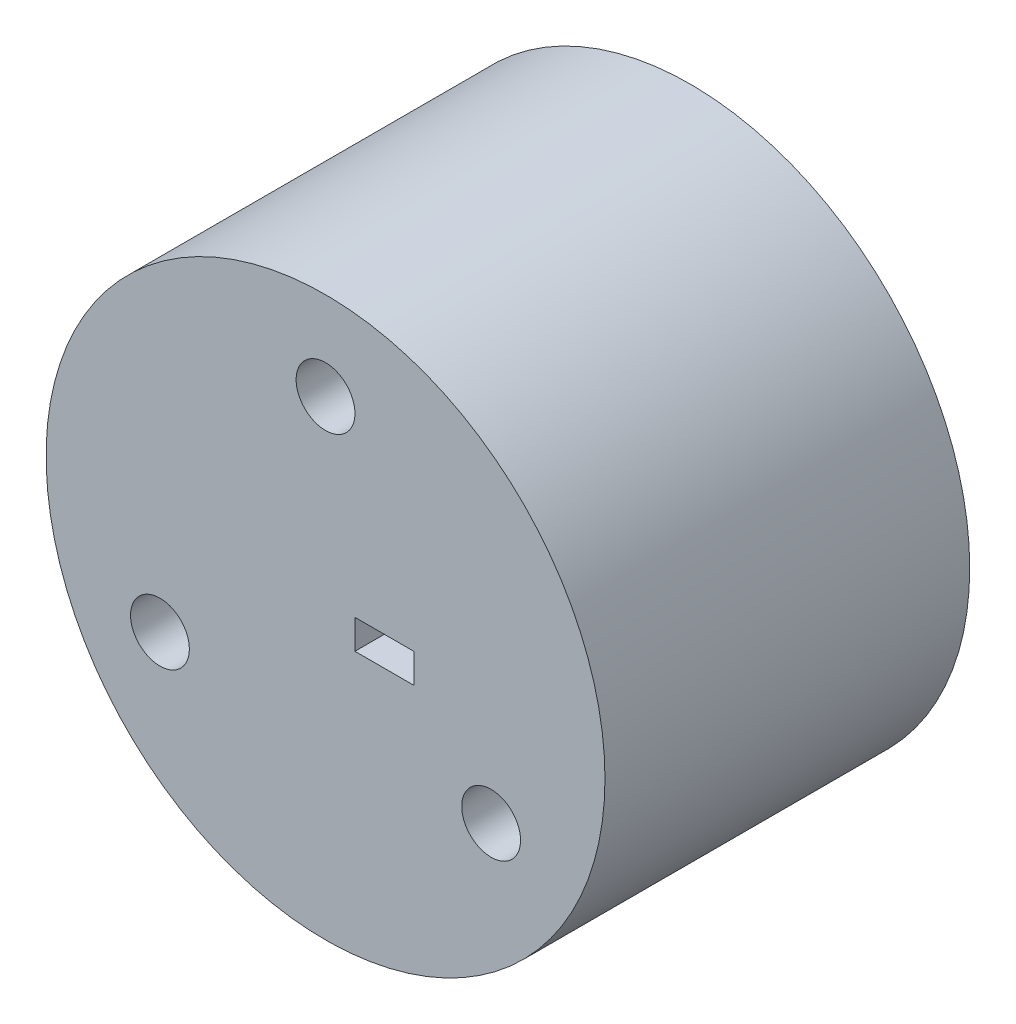
ISO-10303-21;
HEADER;
FILE_DESCRIPTION(('STEP AP214'),'2;1');
FILE_NAME('part.step','',(''),(''),'','','');
FILE_SCHEMA(('AUTOMOTIVE_DESIGN { 1 0 10303 214 1 1 1 1 }'));
ENDSEC;
DATA;
#1=APPLICATION_CONTEXT('core data for automotive mechanical design processes');
#2=APPLICATION_PROTOCOL_DEFINITION('international standard','automotive_design',2000,#1);
#3=PRODUCT_CONTEXT('',#1,'mechanical');
#4=PRODUCT('Part','Part','',(#3));
#5=PRODUCT_RELATED_PRODUCT_CATEGORY('part','',(#4));
#6=PRODUCT_DEFINITION_FORMATION('','',#4);
#7=PRODUCT_DEFINITION_CONTEXT('part definition',#1,'design');
#8=PRODUCT_DEFINITION('design','',#6,#7);
#9=PRODUCT_DEFINITION_SHAPE('','',#8);
#10=(LENGTH_UNIT() NAMED_UNIT(*) SI_UNIT(.MILLI.,.METRE.));
#11=(NAMED_UNIT(*) PLANE_ANGLE_UNIT() SI_UNIT($,.RADIAN.));
#12=(NAMED_UNIT(*) SI_UNIT($,.STERADIAN.) SOLID_ANGLE_UNIT());
#13=UNCERTAINTY_MEASURE_WITH_UNIT(LENGTH_MEASURE(1.E-05),#10,'distance_accuracy_value','');
#14=(GEOMETRIC_REPRESENTATION_CONTEXT(3) GLOBAL_UNCERTAINTY_ASSIGNED_CONTEXT((#13)) GLOBAL_UNIT_ASSIGNED_CONTEXT((#10,
#11,#12)) REPRESENTATION_CONTEXT('',''));
#15=CARTESIAN_POINT('',(0.,0.,0.));
#16=DIRECTION('',(0.,0.,1.));
#17=DIRECTION('',(1.,0.,0.));
#18=AXIS2_PLACEMENT_3D('',#15,#16,#17);
#19=CARTESIAN_POINT('',(0.,0.,62.));
#20=DIRECTION('',(0.,0.,-1.));
#21=DIRECTION('',(-1.,0.,0.));
#22=AXIS2_PLACEMENT_3D('',#19,#20,#21);
#23=CYLINDRICAL_SURFACE('',#22,47.5);
#24=CARTESIAN_POINT('',(0.,0.,62.));
#25=DIRECTION('',(0.,0.,1.));
#26=DIRECTION('',(1.,0.,0.));
#27=AXIS2_PLACEMENT_3D('',#24,#25,#26);
#28=CIRCLE('',#27,47.5);
#29=CARTESIAN_POINT('',(47.5,0.,62.));
#30=VERTEX_POINT('',#29);
#31=EDGE_CURVE('E11',#30,#30,#28,.T.);
#32=ORIENTED_EDGE('',*,*,#31,.F.);
#33=EDGE_LOOP('',(#32));
#34=FACE_BOUND('',#33,.T.);
#35=CARTESIAN_POINT('',(0.,0.,0.));
#36=DIRECTION('',(0.,0.,1.));
#37=DIRECTION('',(1.,0.,0.));
#38=AXIS2_PLACEMENT_3D('',#35,#36,#37);
#39=CIRCLE('',#38,47.5);
#40=CARTESIAN_POINT('',(47.5,0.,0.));
#41=VERTEX_POINT('',#40);
#42=EDGE_CURVE('E38',#41,#41,#39,.T.);
#43=ORIENTED_EDGE('',*,*,#42,.T.);
#44=EDGE_LOOP('',(#43));
#45=FACE_BOUND('',#44,.T.);
#46=ADVANCED_FACE('F35',(#34,#45),#23,.T.);
#47=CARTESIAN_POINT('',(0.,0.,62.));
#48=DIRECTION('',(0.,0.,1.));
#49=DIRECTION('',(1.,0.,0.));
#50=AXIS2_PLACEMENT_3D('',#47,#48,#49);
#51=PLANE('',#50);
#52=CARTESIAN_POINT('',(-28.1458256229929,-16.2500000000008,62.));
#53=DIRECTION('',(0.,0.,1.));
#54=DIRECTION('',(1.,0.,0.));
#55=AXIS2_PLACEMENT_3D('',#52,#53,#54);
#56=CIRCLE('',#55,5.);
#57=CARTESIAN_POINT('',(-23.1458256229929,-16.2500000000008,62.));
#58=VERTEX_POINT('',#57);
#59=EDGE_CURVE('E175',#58,#58,#56,.T.);
#60=ORIENTED_EDGE('',*,*,#59,.F.);
#61=EDGE_LOOP('',(#60));
#62=FACE_BOUND('',#61,.T.);
#63=CARTESIAN_POINT('',(28.1458256229956,-16.2499999999992,62.));
#64=DIRECTION('',(0.,0.,1.));
#65=DIRECTION('',(1.,0.,0.));
#66=AXIS2_PLACEMENT_3D('',#63,#64,#65);
#67=CIRCLE('',#66,5.);
#68=CARTESIAN_POINT('',(33.1458256229956,-16.2499999999992,62.));
#69=VERTEX_POINT('',#68);
#70=EDGE_CURVE('E177',#69,#69,#67,.T.);
#71=ORIENTED_EDGE('',*,*,#70,.F.);
#72=EDGE_LOOP('',(#71));
#73=FACE_BOUND('',#72,.T.);
#74=CARTESIAN_POINT('',(0.,32.5,62.));
#75=DIRECTION('',(0.,0.,1.));
#76=DIRECTION('',(1.,0.,0.));
#77=AXIS2_PLACEMENT_3D('',#74,#75,#76);
#78=CIRCLE('',#77,5.);
#79=CARTESIAN_POINT('',(5.,32.5,62.));
#80=VERTEX_POINT('',#79);
#81=EDGE_CURVE('E183',#80,#80,#78,.T.);
#82=ORIENTED_EDGE('',*,*,#81,.F.);
#83=EDGE_LOOP('',(#82));
#84=FACE_BOUND('',#83,.T.);
#85=DIRECTION('',(0.,1.,0.));
#86=VECTOR('',#85,1.);
#87=CARTESIAN_POINT('',(15.,2.5,62.));
#88=LINE('',#87,#86);
#89=CARTESIAN_POINT('',(15.,-2.5,62.));
#90=VERTEX_POINT('',#89);
#91=CARTESIAN_POINT('',(15.,2.5,62.));
#92=VERTEX_POINT('',#91);
#93=EDGE_CURVE('E49',#90,#92,#88,.T.);
#94=ORIENTED_EDGE('',*,*,#93,.F.);
#95=DIRECTION('',(1.,0.,0.));
#96=VECTOR('',#95,1.);
#97=CARTESIAN_POINT('',(5.,-2.5,62.));
#98=LINE('',#97,#96);
#99=CARTESIAN_POINT('',(5.,-2.5,62.));
#100=VERTEX_POINT('',#99);
#101=EDGE_CURVE('E100',#100,#90,#98,.T.);
#102=ORIENTED_EDGE('',*,*,#101,.F.);
#103=DIRECTION('',(0.,-1.,0.));
#104=VECTOR('',#103,1.);
#105=CARTESIAN_POINT('',(5.,2.5,62.));
#106=LINE('',#105,#104);
#107=CARTESIAN_POINT('',(5.,2.5,62.));
#108=VERTEX_POINT('',#107);
#109=EDGE_CURVE('E108',#108,#100,#106,.T.);
#110=ORIENTED_EDGE('',*,*,#109,.F.);
#111=DIRECTION('',(-1.,0.,0.));
#112=VECTOR('',#111,1.);
#113=CARTESIAN_POINT('',(5.,2.5,62.));
#114=LINE('',#113,#112);
#115=EDGE_CURVE('E84',#92,#108,#114,.T.);
#116=ORIENTED_EDGE('',*,*,#115,.F.);
#117=EDGE_LOOP('',(#94,#102,#110,#116));
#118=FACE_BOUND('',#117,.T.);
#119=ORIENTED_EDGE('',*,*,#31,.T.);
#120=EDGE_LOOP('',(#119));
#121=FACE_BOUND('',#120,.T.);
#122=ADVANCED_FACE('F114',(#62,#73,#84,#118,#121),#51,.T.);
#123=CARTESIAN_POINT('',(0.,0.,0.));
#124=DIRECTION('',(0.,0.,1.));
#125=DIRECTION('',(1.,0.,0.));
#126=AXIS2_PLACEMENT_3D('',#123,#124,#125);
#127=PLANE('',#126);
#128=CARTESIAN_POINT('',(-28.1458256229929,-16.2500000000008,0.));
#129=DIRECTION('',(0.,0.,1.));
#130=DIRECTION('',(1.,0.,0.));
#131=AXIS2_PLACEMENT_3D('',#128,#129,#130);
#132=CIRCLE('',#131,5.);
#133=CARTESIAN_POINT('',(-23.1458256229929,-16.2500000000008,0.));
#134=VERTEX_POINT('',#133);
#135=EDGE_CURVE('E172',#134,#134,#132,.T.);
#136=ORIENTED_EDGE('',*,*,#135,.T.);
#137=EDGE_LOOP('',(#136));
#138=FACE_BOUND('',#137,.T.);
#139=CARTESIAN_POINT('',(28.1458256229956,-16.2499999999992,0.));
#140=DIRECTION('',(0.,0.,1.));
#141=DIRECTION('',(1.,0.,0.));
#142=AXIS2_PLACEMENT_3D('',#139,#140,#141);
#143=CIRCLE('',#142,5.);
#144=CARTESIAN_POINT('',(33.1458256229956,-16.2499999999992,0.));
#145=VERTEX_POINT('',#144);
#146=EDGE_CURVE('E180',#145,#145,#143,.T.);
#147=ORIENTED_EDGE('',*,*,#146,.T.);
#148=EDGE_LOOP('',(#147));
#149=FACE_BOUND('',#148,.T.);
#150=CARTESIAN_POINT('',(0.,32.5,0.));
#151=DIRECTION('',(0.,0.,1.));
#152=DIRECTION('',(1.,0.,0.));
#153=AXIS2_PLACEMENT_3D('',#150,#151,#152);
#154=CIRCLE('',#153,5.);
#155=CARTESIAN_POINT('',(5.,32.5,0.));
#156=VERTEX_POINT('',#155);
#157=EDGE_CURVE('E106',#156,#156,#154,.T.);
#158=ORIENTED_EDGE('',*,*,#157,.T.);
#159=EDGE_LOOP('',(#158));
#160=FACE_BOUND('',#159,.T.);
#161=ORIENTED_EDGE('',*,*,#42,.F.);
#162=EDGE_LOOP('',(#161));
#163=FACE_BOUND('',#162,.T.);
#164=ADVANCED_FACE('F126',(#138,#149,#160,#163),#127,.F.);
#165=CARTESIAN_POINT('',(15.,2.5,42.));
#166=DIRECTION('',(1.,0.,0.));
#167=DIRECTION('',(0.,0.,-1.));
#168=AXIS2_PLACEMENT_3D('',#165,#166,#167);
#169=PLANE('',#168);
#170=ORIENTED_EDGE('',*,*,#93,.T.);
#171=DIRECTION('',(0.,0.,1.));
#172=VECTOR('',#171,1.);
#173=CARTESIAN_POINT('',(15.,2.5,42.));
#174=LINE('',#173,#172);
#175=CARTESIAN_POINT('',(15.,2.5,42.));
#176=VERTEX_POINT('',#175);
#177=EDGE_CURVE('E72',#176,#92,#174,.T.);
#178=ORIENTED_EDGE('',*,*,#177,.F.);
#179=DIRECTION('',(0.,1.,0.));
#180=VECTOR('',#179,1.);
#181=CARTESIAN_POINT('',(15.,2.5,42.));
#182=LINE('',#181,#180);
#183=CARTESIAN_POINT('',(15.,-2.5,42.));
#184=VERTEX_POINT('',#183);
#185=EDGE_CURVE('E98',#184,#176,#182,.T.);
#186=ORIENTED_EDGE('',*,*,#185,.F.);
#187=DIRECTION('',(0.,0.,1.));
#188=VECTOR('',#187,1.);
#189=CARTESIAN_POINT('',(15.,-2.5,42.));
#190=LINE('',#189,#188);
#191=EDGE_CURVE('E57',#184,#90,#190,.T.);
#192=ORIENTED_EDGE('',*,*,#191,.T.);
#193=EDGE_LOOP('',(#170,#178,#186,#192));
#194=FACE_BOUND('',#193,.T.);
#195=ADVANCED_FACE('F119',(#194),#169,.F.);
#196=CARTESIAN_POINT('',(5.,-2.5,42.));
#197=DIRECTION('',(0.,-1.,0.));
#198=DIRECTION('',(0.,0.,-1.));
#199=AXIS2_PLACEMENT_3D('',#196,#197,#198);
#200=PLANE('',#199);
#201=ORIENTED_EDGE('',*,*,#101,.T.);
#202=ORIENTED_EDGE('',*,*,#191,.F.);
#203=DIRECTION('',(1.,0.,0.));
#204=VECTOR('',#203,1.);
#205=CARTESIAN_POINT('',(5.,-2.5,42.));
#206=LINE('',#205,#204);
#207=CARTESIAN_POINT('',(5.,-2.5,42.));
#208=VERTEX_POINT('',#207);
#209=EDGE_CURVE('E95',#208,#184,#206,.T.);
#210=ORIENTED_EDGE('',*,*,#209,.F.);
#211=DIRECTION('',(0.,0.,1.));
#212=VECTOR('',#211,1.);
#213=CARTESIAN_POINT('',(5.,-2.5,42.));
#214=LINE('',#213,#212);
#215=EDGE_CURVE('E88',#208,#100,#214,.T.);
#216=ORIENTED_EDGE('',*,*,#215,.T.);
#217=EDGE_LOOP('',(#201,#202,#210,#216));
#218=FACE_BOUND('',#217,.T.);
#219=ADVANCED_FACE('F117',(#218),#200,.F.);
#220=CARTESIAN_POINT('',(5.,2.5,42.));
#221=DIRECTION('',(-1.,0.,0.));
#222=DIRECTION('',(0.,-1.,0.));
#223=AXIS2_PLACEMENT_3D('',#220,#221,#222);
#224=PLANE('',#223);
#225=ORIENTED_EDGE('',*,*,#109,.T.);
#226=ORIENTED_EDGE('',*,*,#215,.F.);
#227=DIRECTION('',(0.,-1.,0.));
#228=VECTOR('',#227,1.);
#229=CARTESIAN_POINT('',(5.,2.5,42.));
#230=LINE('',#229,#228);
#231=CARTESIAN_POINT('',(5.,2.5,42.));
#232=VERTEX_POINT('',#231);
#233=EDGE_CURVE('E91',#232,#208,#230,.T.);
#234=ORIENTED_EDGE('',*,*,#233,.F.);
#235=DIRECTION('',(0.,0.,1.));
#236=VECTOR('',#235,1.);
#237=CARTESIAN_POINT('',(5.,2.5,42.));
#238=LINE('',#237,#236);
#239=EDGE_CURVE('E77',#232,#108,#238,.T.);
#240=ORIENTED_EDGE('',*,*,#239,.T.);
#241=EDGE_LOOP('',(#225,#226,#234,#240));
#242=FACE_BOUND('',#241,.T.);
#243=ADVANCED_FACE('F92',(#242),#224,.F.);
#244=CARTESIAN_POINT('',(5.,2.5,42.));
#245=DIRECTION('',(0.,1.,0.));
#246=DIRECTION('',(0.,0.,1.));
#247=AXIS2_PLACEMENT_3D('',#244,#245,#246);
#248=PLANE('',#247);
#249=ORIENTED_EDGE('',*,*,#115,.T.);
#250=ORIENTED_EDGE('',*,*,#239,.F.);
#251=DIRECTION('',(-1.,0.,0.));
#252=VECTOR('',#251,1.);
#253=CARTESIAN_POINT('',(5.,2.5,42.));
#254=LINE('',#253,#252);
#255=EDGE_CURVE('E81',#176,#232,#254,.T.);
#256=ORIENTED_EDGE('',*,*,#255,.F.);
#257=ORIENTED_EDGE('',*,*,#177,.T.);
#258=EDGE_LOOP('',(#249,#250,#256,#257));
#259=FACE_BOUND('',#258,.T.);
#260=ADVANCED_FACE('F79',(#259),#248,.F.);
#261=CARTESIAN_POINT('',(0.,0.,42.));
#262=DIRECTION('',(0.,0.,1.));
#263=DIRECTION('',(1.,0.,0.));
#264=AXIS2_PLACEMENT_3D('',#261,#262,#263);
#265=PLANE('',#264);
#266=ORIENTED_EDGE('',*,*,#185,.T.);
#267=ORIENTED_EDGE('',*,*,#255,.T.);
#268=ORIENTED_EDGE('',*,*,#233,.T.);
#269=ORIENTED_EDGE('',*,*,#209,.T.);
#270=EDGE_LOOP('',(#266,#267,#268,#269));
#271=FACE_BOUND('',#270,.T.);
#272=ADVANCED_FACE('F97',(#271),#265,.T.);
#273=CARTESIAN_POINT('',(0.,32.5,0.));
#274=DIRECTION('',(0.,0.,1.));
#275=DIRECTION('',(1.,0.,0.));
#276=AXIS2_PLACEMENT_3D('',#273,#274,#275);
#277=CYLINDRICAL_SURFACE('',#276,5.);
#278=ORIENTED_EDGE('',*,*,#157,.F.);
#279=EDGE_LOOP('',(#278));
#280=FACE_BOUND('',#279,.T.);
#281=ORIENTED_EDGE('',*,*,#81,.T.);
#282=EDGE_LOOP('',(#281));
#283=FACE_BOUND('',#282,.T.);
#284=ADVANCED_FACE('F154',(#280,#283),#277,.F.);
#285=CARTESIAN_POINT('',(28.1458256229956,-16.2499999999992,0.));
#286=DIRECTION('',(0.,0.,1.));
#287=DIRECTION('',(1.,0.,0.));
#288=AXIS2_PLACEMENT_3D('',#285,#286,#287);
#289=CYLINDRICAL_SURFACE('',#288,5.);
#290=ORIENTED_EDGE('',*,*,#146,.F.);
#291=EDGE_LOOP('',(#290));
#292=FACE_BOUND('',#291,.T.);
#293=ORIENTED_EDGE('',*,*,#70,.T.);
#294=EDGE_LOOP('',(#293));
#295=FACE_BOUND('',#294,.T.);
#296=ADVANCED_FACE('F158',(#292,#295),#289,.F.);
#297=CARTESIAN_POINT('',(-28.1458256229929,-16.2500000000008,0.));
#298=DIRECTION('',(0.,0.,1.));
#299=DIRECTION('',(1.,0.,0.));
#300=AXIS2_PLACEMENT_3D('',#297,#298,#299);
#301=CYLINDRICAL_SURFACE('',#300,5.);
#302=ORIENTED_EDGE('',*,*,#135,.F.);
#303=EDGE_LOOP('',(#302));
#304=FACE_BOUND('',#303,.T.);
#305=ORIENTED_EDGE('',*,*,#59,.T.);
#306=EDGE_LOOP('',(#305));
#307=FACE_BOUND('',#306,.T.);
#308=ADVANCED_FACE('F164',(#304,#307),#301,.F.);
#309=CLOSED_SHELL('',(#46,#122,#164,#195,#219,#243,#260,#272,#284,#296,#308));
#310=MANIFOLD_SOLID_BREP('B2',#309);
#311=ADVANCED_BREP_SHAPE_REPRESENTATION('',(#18,#310),#14);
#312=SHAPE_DEFINITION_REPRESENTATION(#9,#311);
ENDSEC;
END-ISO-10303-21;
